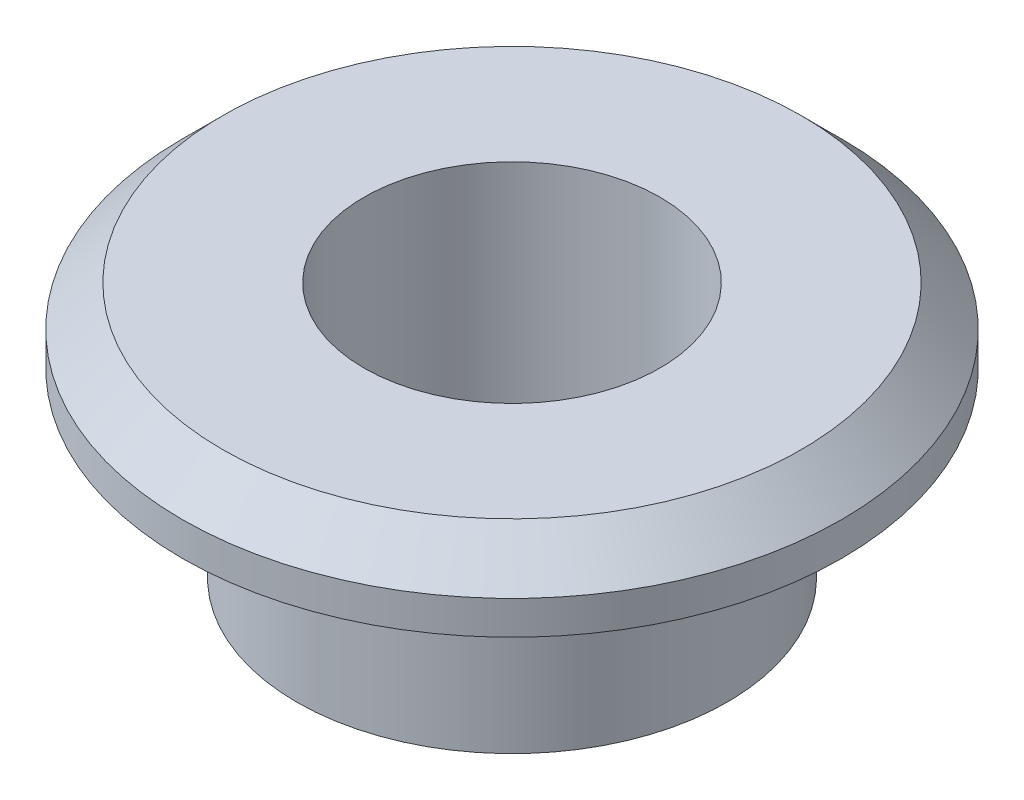
ISO-10303-21;
HEADER;
FILE_DESCRIPTION(('STEP AP214'),'2;1');
FILE_NAME('part.step','',(''),(''),'','','');
FILE_SCHEMA(('AUTOMOTIVE_DESIGN { 1 0 10303 214 1 1 1 1 }'));
ENDSEC;
DATA;
#1=APPLICATION_CONTEXT('core data for automotive mechanical design processes');
#2=APPLICATION_PROTOCOL_DEFINITION('international standard','automotive_design',2000,#1);
#3=PRODUCT_CONTEXT('',#1,'mechanical');
#4=PRODUCT('Part','Part','',(#3));
#5=PRODUCT_RELATED_PRODUCT_CATEGORY('part','',(#4));
#6=PRODUCT_DEFINITION_FORMATION('','',#4);
#7=PRODUCT_DEFINITION_CONTEXT('part definition',#1,'design');
#8=PRODUCT_DEFINITION('design','',#6,#7);
#9=PRODUCT_DEFINITION_SHAPE('','',#8);
#10=(LENGTH_UNIT() NAMED_UNIT(*) SI_UNIT(.MILLI.,.METRE.));
#11=(NAMED_UNIT(*) PLANE_ANGLE_UNIT() SI_UNIT($,.RADIAN.));
#12=(NAMED_UNIT(*) SI_UNIT($,.STERADIAN.) SOLID_ANGLE_UNIT());
#13=UNCERTAINTY_MEASURE_WITH_UNIT(LENGTH_MEASURE(1.E-05),#10,'distance_accuracy_value','');
#14=(GEOMETRIC_REPRESENTATION_CONTEXT(3) GLOBAL_UNCERTAINTY_ASSIGNED_CONTEXT((#13)) GLOBAL_UNIT_ASSIGNED_CONTEXT((#10,
#11,#12)) REPRESENTATION_CONTEXT('',''));
#15=CARTESIAN_POINT('',(0.,0.,0.));
#16=DIRECTION('',(0.,0.,1.));
#17=DIRECTION('',(1.,0.,0.));
#18=AXIS2_PLACEMENT_3D('',#15,#16,#17);
#19=CARTESIAN_POINT('',(1.1,0.,0.));
#20=DIRECTION('',(0.,1.,0.));
#21=DIRECTION('',(0.,0.,1.));
#22=AXIS2_PLACEMENT_3D('',#19,#20,#21);
#23=PLANE('',#22);
#24=CARTESIAN_POINT('',(0.,0.,0.));
#25=DIRECTION('',(0.,1.,0.));
#26=DIRECTION('',(0.,0.,1.));
#27=AXIS2_PLACEMENT_3D('',#24,#25,#26);
#28=CIRCLE('',#27,1.6);
#29=CARTESIAN_POINT('',(0.,0.,1.6));
#30=VERTEX_POINT('',#29);
#31=EDGE_CURVE('E10',#30,#30,#28,.T.);
#32=ORIENTED_EDGE('',*,*,#31,.F.);
#33=EDGE_LOOP('',(#32));
#34=FACE_BOUND('',#33,.T.);
#35=CARTESIAN_POINT('',(0.,0.,0.));
#36=DIRECTION('',(0.,1.,0.));
#37=DIRECTION('',(0.,0.,1.));
#38=AXIS2_PLACEMENT_3D('',#35,#36,#37);
#39=CIRCLE('',#38,1.1);
#40=CARTESIAN_POINT('',(0.,0.,1.1));
#41=VERTEX_POINT('',#40);
#42=EDGE_CURVE('E56',#41,#41,#39,.T.);
#43=ORIENTED_EDGE('',*,*,#42,.T.);
#44=EDGE_LOOP('',(#43));
#45=FACE_BOUND('',#44,.T.);
#46=ADVANCED_FACE('F31',(#34,#45),#23,.F.);
#47=CARTESIAN_POINT('',(0.,9.79114795561097,0.));
#48=DIRECTION('',(0.,1.,0.));
#49=DIRECTION('',(0.,0.,1.));
#50=AXIS2_PLACEMENT_3D('',#47,#48,#49);
#51=CYLINDRICAL_SURFACE('',#50,1.6);
#52=CARTESIAN_POINT('',(0.,1.35,0.));
#53=DIRECTION('',(0.,1.,0.));
#54=DIRECTION('',(0.,0.,1.));
#55=AXIS2_PLACEMENT_3D('',#52,#53,#54);
#56=CIRCLE('',#55,1.6);
#57=CARTESIAN_POINT('',(0.,1.35,1.6));
#58=VERTEX_POINT('',#57);
#59=EDGE_CURVE('E37',#58,#58,#56,.T.);
#60=ORIENTED_EDGE('',*,*,#59,.F.);
#61=EDGE_LOOP('',(#60));
#62=FACE_BOUND('',#61,.T.);
#63=ORIENTED_EDGE('',*,*,#31,.T.);
#64=EDGE_LOOP('',(#63));
#65=FACE_BOUND('',#64,.T.);
#66=ADVANCED_FACE('F87',(#62,#65),#51,.T.);
#67=CARTESIAN_POINT('',(1.6,1.35,0.));
#68=DIRECTION('',(0.,1.,0.));
#69=DIRECTION('',(0.,0.,1.));
#70=AXIS2_PLACEMENT_3D('',#67,#68,#69);
#71=PLANE('',#70);
#72=CARTESIAN_POINT('',(0.,1.35,0.));
#73=DIRECTION('',(0.,1.,0.));
#74=DIRECTION('',(0.,0.,1.));
#75=AXIS2_PLACEMENT_3D('',#72,#73,#74);
#76=CIRCLE('',#75,2.45);
#77=CARTESIAN_POINT('',(0.,1.35,2.45));
#78=VERTEX_POINT('',#77);
#79=EDGE_CURVE('E41',#78,#78,#76,.T.);
#80=ORIENTED_EDGE('',*,*,#79,.F.);
#81=EDGE_LOOP('',(#80));
#82=FACE_BOUND('',#81,.T.);
#83=ORIENTED_EDGE('',*,*,#59,.T.);
#84=EDGE_LOOP('',(#83));
#85=FACE_BOUND('',#84,.T.);
#86=ADVANCED_FACE('F82',(#82,#85),#71,.F.);
#87=CARTESIAN_POINT('',(0.,9.79114795561097,0.));
#88=DIRECTION('',(0.,1.,0.));
#89=DIRECTION('',(0.,0.,1.));
#90=AXIS2_PLACEMENT_3D('',#87,#88,#89);
#91=CYLINDRICAL_SURFACE('',#90,2.45);
#92=CARTESIAN_POINT('',(0.,1.6,0.));
#93=DIRECTION('',(0.,1.,0.));
#94=DIRECTION('',(0.,0.,1.));
#95=AXIS2_PLACEMENT_3D('',#92,#93,#94);
#96=CIRCLE('',#95,2.45);
#97=CARTESIAN_POINT('',(0.,1.6,2.45));
#98=VERTEX_POINT('',#97);
#99=EDGE_CURVE('E45',#98,#98,#96,.T.);
#100=ORIENTED_EDGE('',*,*,#99,.F.);
#101=EDGE_LOOP('',(#100));
#102=FACE_BOUND('',#101,.T.);
#103=ORIENTED_EDGE('',*,*,#79,.T.);
#104=EDGE_LOOP('',(#103));
#105=FACE_BOUND('',#104,.T.);
#106=ADVANCED_FACE('F76',(#102,#105),#91,.T.);
#107=CARTESIAN_POINT('',(0.,1.6,0.));
#108=DIRECTION('',(0.,-1.,0.));
#109=DIRECTION('',(0.,0.,-1.));
#110=AXIS2_PLACEMENT_3D('',#107,#108,#109);
#111=CONICAL_SURFACE('',#110,2.45,0.785398163397448);
#112=CARTESIAN_POINT('',(0.,1.9,0.));
#113=DIRECTION('',(0.,1.,0.));
#114=DIRECTION('',(0.,0.,1.));
#115=AXIS2_PLACEMENT_3D('',#112,#113,#114);
#116=CIRCLE('',#115,2.15);
#117=CARTESIAN_POINT('',(0.,1.9,2.15));
#118=VERTEX_POINT('',#117);
#119=EDGE_CURVE('E50',#118,#118,#116,.T.);
#120=ORIENTED_EDGE('',*,*,#119,.F.);
#121=EDGE_LOOP('',(#120));
#122=FACE_BOUND('',#121,.T.);
#123=ORIENTED_EDGE('',*,*,#99,.T.);
#124=EDGE_LOOP('',(#123));
#125=FACE_BOUND('',#124,.T.);
#126=ADVANCED_FACE('F70',(#122,#125),#111,.T.);
#127=CARTESIAN_POINT('',(2.15,1.9,0.));
#128=DIRECTION('',(0.,-1.,0.));
#129=DIRECTION('',(0.,0.,-1.));
#130=AXIS2_PLACEMENT_3D('',#127,#128,#129);
#131=PLANE('',#130);
#132=CARTESIAN_POINT('',(0.,1.9,0.));
#133=DIRECTION('',(0.,1.,0.));
#134=DIRECTION('',(0.,0.,1.));
#135=AXIS2_PLACEMENT_3D('',#132,#133,#134);
#136=CIRCLE('',#135,1.1);
#137=CARTESIAN_POINT('',(0.,1.9,1.1));
#138=VERTEX_POINT('',#137);
#139=EDGE_CURVE('E53',#138,#138,#136,.T.);
#140=ORIENTED_EDGE('',*,*,#139,.F.);
#141=EDGE_LOOP('',(#140));
#142=FACE_BOUND('',#141,.T.);
#143=ORIENTED_EDGE('',*,*,#119,.T.);
#144=EDGE_LOOP('',(#143));
#145=FACE_BOUND('',#144,.T.);
#146=ADVANCED_FACE('F64',(#142,#145),#131,.F.);
#147=CARTESIAN_POINT('',(0.,9.79114795561097,0.));
#148=DIRECTION('',(0.,1.,0.));
#149=DIRECTION('',(0.,0.,1.));
#150=AXIS2_PLACEMENT_3D('',#147,#148,#149);
#151=CYLINDRICAL_SURFACE('',#150,1.1);
#152=ORIENTED_EDGE('',*,*,#42,.F.);
#153=EDGE_LOOP('',(#152));
#154=FACE_BOUND('',#153,.T.);
#155=ORIENTED_EDGE('',*,*,#139,.T.);
#156=EDGE_LOOP('',(#155));
#157=FACE_BOUND('',#156,.T.);
#158=ADVANCED_FACE('F61',(#154,#157),#151,.F.);
#159=CLOSED_SHELL('',(#46,#66,#86,#106,#126,#146,#158));
#160=MANIFOLD_SOLID_BREP('B2',#159);
#161=ADVANCED_BREP_SHAPE_REPRESENTATION('',(#18,#160),#14);
#162=SHAPE_DEFINITION_REPRESENTATION(#9,#161);
ENDSEC;
END-ISO-10303-21;
